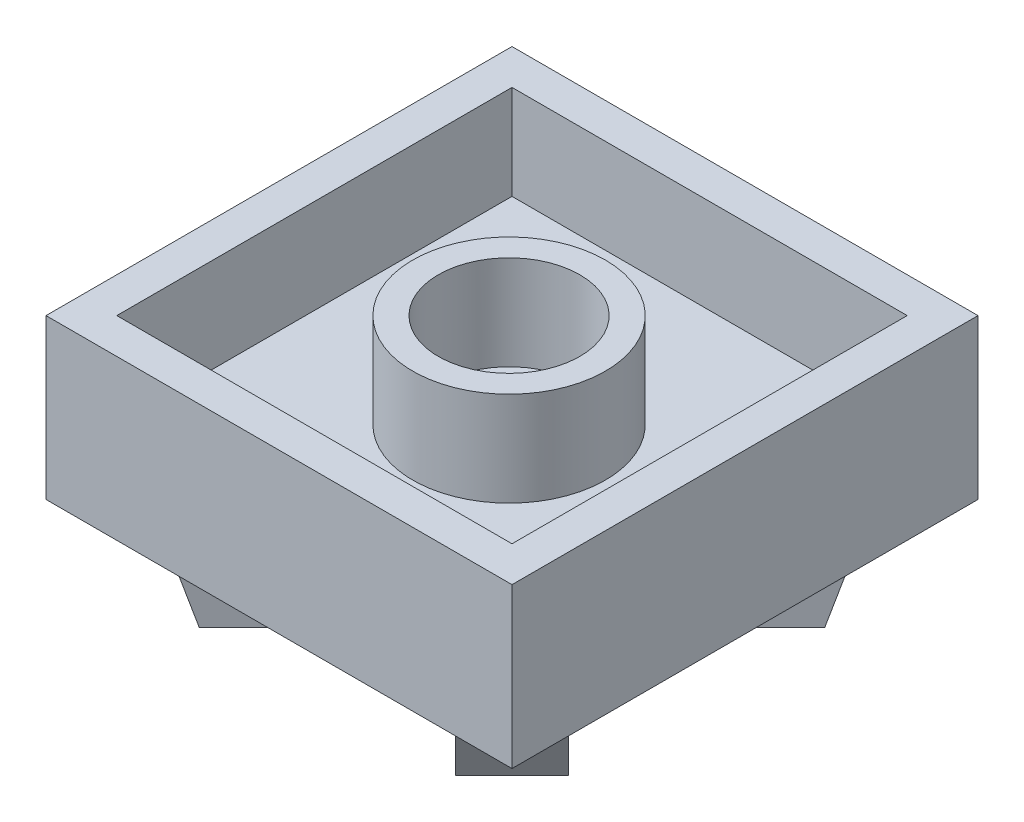
ISO-10303-21;
HEADER;
FILE_DESCRIPTION(('STEP AP214'),'2;1');
FILE_NAME('part.step','',(''),(''),'','','');
FILE_SCHEMA(('AUTOMOTIVE_DESIGN { 1 0 10303 214 1 1 1 1 }'));
ENDSEC;
DATA;
#1=APPLICATION_CONTEXT('core data for automotive mechanical design processes');
#2=APPLICATION_PROTOCOL_DEFINITION('international standard','automotive_design',2000,#1);
#3=PRODUCT_CONTEXT('',#1,'mechanical');
#4=PRODUCT('Part','Part','',(#3));
#5=PRODUCT_RELATED_PRODUCT_CATEGORY('part','',(#4));
#6=PRODUCT_DEFINITION_FORMATION('','',#4);
#7=PRODUCT_DEFINITION_CONTEXT('part definition',#1,'design');
#8=PRODUCT_DEFINITION('design','',#6,#7);
#9=PRODUCT_DEFINITION_SHAPE('','',#8);
#10=(LENGTH_UNIT() NAMED_UNIT(*) SI_UNIT(.MILLI.,.METRE.));
#11=(NAMED_UNIT(*) PLANE_ANGLE_UNIT() SI_UNIT($,.RADIAN.));
#12=(NAMED_UNIT(*) SI_UNIT($,.STERADIAN.) SOLID_ANGLE_UNIT());
#13=UNCERTAINTY_MEASURE_WITH_UNIT(LENGTH_MEASURE(1.E-05),#10,'distance_accuracy_value','');
#14=(GEOMETRIC_REPRESENTATION_CONTEXT(3) GLOBAL_UNCERTAINTY_ASSIGNED_CONTEXT((#13)) GLOBAL_UNIT_ASSIGNED_CONTEXT((#10,
#11,#12)) REPRESENTATION_CONTEXT('',''));
#15=CARTESIAN_POINT('',(0.,0.,0.));
#16=DIRECTION('',(0.,0.,1.));
#17=DIRECTION('',(1.,0.,0.));
#18=AXIS2_PLACEMENT_3D('',#15,#16,#17);
#19=CARTESIAN_POINT('',(0.,-5.4,0.));
#20=DIRECTION('',(0.,-1.,0.));
#21=DIRECTION('',(0.,0.,-1.));
#22=AXIS2_PLACEMENT_3D('',#19,#20,#21);
#23=PLANE('',#22);
#24=DIRECTION('',(0.,0.,1.));
#25=VECTOR('',#24,1.);
#26=CARTESIAN_POINT('',(0.,-5.4,0.));
#27=LINE('',#26,#25);
#28=CARTESIAN_POINT('',(0.,-5.4,-15.8));
#29=VERTEX_POINT('',#28);
#30=CARTESIAN_POINT('',(0.,-5.4,0.));
#31=VERTEX_POINT('',#30);
#32=EDGE_CURVE('E371',#29,#31,#27,.T.);
#33=ORIENTED_EDGE('',*,*,#32,.F.);
#34=DIRECTION('',(-1.,0.,0.));
#35=VECTOR('',#34,1.);
#36=CARTESIAN_POINT('',(0.,-5.4,-15.8));
#37=LINE('',#36,#35);
#38=CARTESIAN_POINT('',(15.8,-5.4,-15.8));
#39=VERTEX_POINT('',#38);
#40=EDGE_CURVE('E381',#39,#29,#37,.T.);
#41=ORIENTED_EDGE('',*,*,#40,.F.);
#42=DIRECTION('',(0.,0.,-1.));
#43=VECTOR('',#42,1.);
#44=CARTESIAN_POINT('',(15.8,-5.4,0.));
#45=LINE('',#44,#43);
#46=CARTESIAN_POINT('',(15.8,-5.4,0.));
#47=VERTEX_POINT('',#46);
#48=EDGE_CURVE('E378',#47,#39,#45,.T.);
#49=ORIENTED_EDGE('',*,*,#48,.F.);
#50=DIRECTION('',(1.,0.,0.));
#51=VECTOR('',#50,1.);
#52=CARTESIAN_POINT('',(0.,-5.4,0.));
#53=LINE('',#52,#51);
#54=EDGE_CURVE('E374',#31,#47,#53,.T.);
#55=ORIENTED_EDGE('',*,*,#54,.F.);
#56=EDGE_LOOP('',(#33,#41,#49,#55));
#57=FACE_BOUND('',#56,.T.);
#58=DIRECTION('',(0.707106781186541,0.,0.707106781186555));
#59=VECTOR('',#58,1.);
#60=CARTESIAN_POINT('',(12.8851028073652,-5.4,-14.7942911165688));
#61=LINE('',#60,#59);
#62=CARTESIAN_POINT('',(12.8851028073652,-5.4,-14.7942911165688));
#63=VERTEX_POINT('',#62);
#64=CARTESIAN_POINT('',(14.7942911165689,-5.4,-12.8851028073651));
#65=VERTEX_POINT('',#64);
#66=EDGE_CURVE('E216',#63,#65,#61,.T.);
#67=ORIENTED_EDGE('',*,*,#66,.F.);
#68=DIRECTION('',(0.707106781186557,0.,-0.707106781186538));
#69=VECTOR('',#68,1.);
#70=CARTESIAN_POINT('',(6.94540584539818,-5.4,-8.85459415460189));
#71=LINE('',#70,#69);
#72=CARTESIAN_POINT('',(10.4596625235593,-5.4,-12.3688508327629));
#73=VERTEX_POINT('',#72);
#74=EDGE_CURVE('E199',#73,#63,#71,.T.);
#75=ORIENTED_EDGE('',*,*,#74,.F.);
#76=CARTESIAN_POINT('',(7.9,-5.4,-7.9));
#77=DIRECTION('',(0.,-1.,0.));
#78=DIRECTION('',(0.,0.,-1.));
#79=AXIS2_PLACEMENT_3D('',#76,#77,#78);
#80=CIRCLE('',#79,5.15);
#81=CARTESIAN_POINT('',(5.34033747644073,-5.4,-12.368850832763));
#82=VERTEX_POINT('',#81);
#83=EDGE_CURVE('E738',#82,#73,#80,.T.);
#84=ORIENTED_EDGE('',*,*,#83,.F.);
#85=DIRECTION('',(-0.707106781186548,0.,-0.707106781186547));
#86=VECTOR('',#85,1.);
#87=CARTESIAN_POINT('',(8.85459415460185,-5.4,-8.85459415460184));
#88=LINE('',#87,#86);
#89=CARTESIAN_POINT('',(2.91489719263485,-5.4,-14.7942911165688));
#90=VERTEX_POINT('',#89);
#91=EDGE_CURVE('E61',#82,#90,#88,.T.);
#92=ORIENTED_EDGE('',*,*,#91,.T.);
#93=DIRECTION('',(0.707106781186547,0.,-0.707106781186548));
#94=VECTOR('',#93,1.);
#95=CARTESIAN_POINT('',(1.00570888343117,-5.4,-12.8851028073652));
#96=LINE('',#95,#94);
#97=CARTESIAN_POINT('',(1.00570888343117,-5.4,-12.8851028073652));
#98=VERTEX_POINT('',#97);
#99=EDGE_CURVE('E229',#98,#90,#96,.T.);
#100=ORIENTED_EDGE('',*,*,#99,.F.);
#101=DIRECTION('',(-0.707106781186546,0.,-0.707106781186549));
#102=VECTOR('',#101,1.);
#103=CARTESIAN_POINT('',(6.94540584539812,-5.4,-6.94540584539817));
#104=LINE('',#103,#102);
#105=CARTESIAN_POINT('',(3.43114916723705,-5.4,-10.4596625235593));
#106=VERTEX_POINT('',#105);
#107=EDGE_CURVE('E257',#106,#98,#104,.T.);
#108=ORIENTED_EDGE('',*,*,#107,.F.);
#109=CARTESIAN_POINT('',(3.43114916723703,-5.4,-5.34033747644074));
#110=VERTEX_POINT('',#109);
#111=EDGE_CURVE('E329',#110,#106,#80,.T.);
#112=ORIENTED_EDGE('',*,*,#111,.F.);
#113=DIRECTION('',(-0.707106781186549,0.,0.707106781186546));
#114=VECTOR('',#113,1.);
#115=CARTESIAN_POINT('',(6.94540584539816,-5.4,-8.85459415460185));
#116=LINE('',#115,#114);
#117=CARTESIAN_POINT('',(1.00570888343115,-5.4,-2.91489719263487));
#118=VERTEX_POINT('',#117);
#119=EDGE_CURVE('E271',#110,#118,#116,.T.);
#120=ORIENTED_EDGE('',*,*,#119,.T.);
#121=DIRECTION('',(-0.707106781186546,0.,-0.70710678118655));
#122=VECTOR('',#121,1.);
#123=CARTESIAN_POINT('',(2.91489719263482,-5.4,-1.00570888343118));
#124=LINE('',#123,#122);
#125=CARTESIAN_POINT('',(2.91489719263482,-5.4,-1.00570888343118));
#126=VERTEX_POINT('',#125);
#127=EDGE_CURVE('E237',#126,#118,#124,.T.);
#128=ORIENTED_EDGE('',*,*,#127,.F.);
#129=DIRECTION('',(-0.707106781186552,0.,0.707106781186543));
#130=VECTOR('',#129,1.);
#131=CARTESIAN_POINT('',(8.85459415460183,-5.4,-6.94540584539812));
#132=LINE('',#131,#130);
#133=CARTESIAN_POINT('',(5.34033747644071,-5.4,-3.43114916723705));
#134=VERTEX_POINT('',#133);
#135=EDGE_CURVE('E276',#134,#126,#132,.T.);
#136=ORIENTED_EDGE('',*,*,#135,.F.);
#137=CARTESIAN_POINT('',(10.4596625235593,-5.4,-3.43114916723704));
#138=VERTEX_POINT('',#137);
#139=EDGE_CURVE('E326',#138,#134,#80,.T.);
#140=ORIENTED_EDGE('',*,*,#139,.F.);
#141=DIRECTION('',(0.707106781186548,0.,0.707106781186547));
#142=VECTOR('',#141,1.);
#143=CARTESIAN_POINT('',(6.94540584539815,-5.4,-6.94540584539816));
#144=LINE('',#143,#142);
#145=CARTESIAN_POINT('',(12.8851028073652,-5.4,-1.00570888343117));
#146=VERTEX_POINT('',#145);
#147=EDGE_CURVE('E300',#138,#146,#144,.T.);
#148=ORIENTED_EDGE('',*,*,#147,.T.);
#149=DIRECTION('',(-0.707106781186547,0.,0.707106781186548));
#150=VECTOR('',#149,1.);
#151=CARTESIAN_POINT('',(14.7942911165688,-5.4,-2.91489719263485));
#152=LINE('',#151,#150);
#153=CARTESIAN_POINT('',(14.7942911165688,-5.4,-2.91489719263485));
#154=VERTEX_POINT('',#153);
#155=EDGE_CURVE('E295',#154,#146,#152,.T.);
#156=ORIENTED_EDGE('',*,*,#155,.F.);
#157=DIRECTION('',(0.707106781186546,0.,0.707106781186549));
#158=VECTOR('',#157,1.);
#159=CARTESIAN_POINT('',(8.85459415460188,-5.4,-8.85459415460183));
#160=LINE('',#159,#158);
#161=CARTESIAN_POINT('',(12.368850832763,-5.4,-5.34033747644073));
#162=VERTEX_POINT('',#161);
#163=EDGE_CURVE('E305',#162,#154,#160,.T.);
#164=ORIENTED_EDGE('',*,*,#163,.F.);
#165=CARTESIAN_POINT('',(12.368850832763,-5.4,-10.4596625235592));
#166=VERTEX_POINT('',#165);
#167=EDGE_CURVE('E321',#166,#162,#80,.T.);
#168=ORIENTED_EDGE('',*,*,#167,.F.);
#169=DIRECTION('',(0.707106781186554,0.,-0.707106781186541));
#170=VECTOR('',#169,1.);
#171=CARTESIAN_POINT('',(8.85459415460183,-5.4,-6.94540584539814));
#172=LINE('',#171,#170);
#173=EDGE_CURVE('E53',#166,#65,#172,.T.);
#174=ORIENTED_EDGE('',*,*,#173,.T.);
#175=EDGE_LOOP('',(#67,#75,#84,#92,#100,#108,#112,#120,#128,#136,#140,#148,#156,#164,#168,#174));
#176=FACE_BOUND('',#175,.T.);
#177=ADVANCED_FACE('F38',(#57,#176),#23,.T.);
#178=CARTESIAN_POINT('',(0.,-5.4,0.));
#179=DIRECTION('',(-1.,0.,0.));
#180=DIRECTION('',(0.,0.,1.));
#181=AXIS2_PLACEMENT_3D('',#178,#179,#180);
#182=PLANE('',#181);
#183=DIRECTION('',(0.,0.,1.));
#184=VECTOR('',#183,1.);
#185=CARTESIAN_POINT('',(0.,0.,0.));
#186=LINE('',#185,#184);
#187=CARTESIAN_POINT('',(0.,0.,-15.8));
#188=VERTEX_POINT('',#187);
#189=CARTESIAN_POINT('',(0.,0.,0.));
#190=VERTEX_POINT('',#189);
#191=EDGE_CURVE('E370',#188,#190,#186,.T.);
#192=ORIENTED_EDGE('',*,*,#191,.F.);
#193=DIRECTION('',(0.,1.,0.));
#194=VECTOR('',#193,1.);
#195=CARTESIAN_POINT('',(0.,-5.4,-15.8));
#196=LINE('',#195,#194);
#197=EDGE_CURVE('E46',#29,#188,#196,.T.);
#198=ORIENTED_EDGE('',*,*,#197,.F.);
#199=ORIENTED_EDGE('',*,*,#32,.T.);
#200=DIRECTION('',(0.,1.,0.));
#201=VECTOR('',#200,1.);
#202=CARTESIAN_POINT('',(0.,-5.4,0.));
#203=LINE('',#202,#201);
#204=EDGE_CURVE('E384',#31,#190,#203,.T.);
#205=ORIENTED_EDGE('',*,*,#204,.T.);
#206=EDGE_LOOP('',(#192,#198,#199,#205));
#207=FACE_BOUND('',#206,.T.);
#208=ADVANCED_FACE('F40',(#207),#182,.T.);
#209=CARTESIAN_POINT('',(0.,-5.4,-15.8));
#210=DIRECTION('',(0.,0.,-1.));
#211=DIRECTION('',(-1.,0.,0.));
#212=AXIS2_PLACEMENT_3D('',#209,#210,#211);
#213=PLANE('',#212);
#214=DIRECTION('',(-1.,0.,0.));
#215=VECTOR('',#214,1.);
#216=CARTESIAN_POINT('',(0.,0.,-15.8));
#217=LINE('',#216,#215);
#218=CARTESIAN_POINT('',(15.8,0.,-15.8));
#219=VERTEX_POINT('',#218);
#220=EDGE_CURVE('E375',#219,#188,#217,.T.);
#221=ORIENTED_EDGE('',*,*,#220,.F.);
#222=DIRECTION('',(0.,1.,0.));
#223=VECTOR('',#222,1.);
#224=CARTESIAN_POINT('',(15.8,-5.4,-15.8));
#225=LINE('',#224,#223);
#226=EDGE_CURVE('E396',#39,#219,#225,.T.);
#227=ORIENTED_EDGE('',*,*,#226,.F.);
#228=ORIENTED_EDGE('',*,*,#40,.T.);
#229=ORIENTED_EDGE('',*,*,#197,.T.);
#230=EDGE_LOOP('',(#221,#227,#228,#229));
#231=FACE_BOUND('',#230,.T.);
#232=ADVANCED_FACE('F411',(#231),#213,.T.);
#233=CARTESIAN_POINT('',(15.8,-5.4,0.));
#234=DIRECTION('',(1.,0.,0.));
#235=DIRECTION('',(0.,0.,-1.));
#236=AXIS2_PLACEMENT_3D('',#233,#234,#235);
#237=PLANE('',#236);
#238=DIRECTION('',(0.,0.,-1.));
#239=VECTOR('',#238,1.);
#240=CARTESIAN_POINT('',(15.8,0.,0.));
#241=LINE('',#240,#239);
#242=CARTESIAN_POINT('',(15.8,0.,0.));
#243=VERTEX_POINT('',#242);
#244=EDGE_CURVE('E390',#243,#219,#241,.T.);
#245=ORIENTED_EDGE('',*,*,#244,.F.);
#246=DIRECTION('',(0.,1.,0.));
#247=VECTOR('',#246,1.);
#248=CARTESIAN_POINT('',(15.8,-5.4,0.));
#249=LINE('',#248,#247);
#250=EDGE_CURVE('E398',#47,#243,#249,.T.);
#251=ORIENTED_EDGE('',*,*,#250,.F.);
#252=ORIENTED_EDGE('',*,*,#48,.T.);
#253=ORIENTED_EDGE('',*,*,#226,.T.);
#254=EDGE_LOOP('',(#245,#251,#252,#253));
#255=FACE_BOUND('',#254,.T.);
#256=ADVANCED_FACE('F416',(#255),#237,.T.);
#257=CARTESIAN_POINT('',(0.,-5.4,0.));
#258=DIRECTION('',(0.,0.,1.));
#259=DIRECTION('',(1.,0.,0.));
#260=AXIS2_PLACEMENT_3D('',#257,#258,#259);
#261=PLANE('',#260);
#262=DIRECTION('',(1.,0.,0.));
#263=VECTOR('',#262,1.);
#264=CARTESIAN_POINT('',(0.,0.,0.));
#265=LINE('',#264,#263);
#266=EDGE_CURVE('E387',#190,#243,#265,.T.);
#267=ORIENTED_EDGE('',*,*,#266,.F.);
#268=ORIENTED_EDGE('',*,*,#204,.F.);
#269=ORIENTED_EDGE('',*,*,#54,.T.);
#270=ORIENTED_EDGE('',*,*,#250,.T.);
#271=EDGE_LOOP('',(#267,#268,#269,#270));
#272=FACE_BOUND('',#271,.T.);
#273=ADVANCED_FACE('F405',(#272),#261,.T.);
#274=CARTESIAN_POINT('',(0.,0.,0.));
#275=DIRECTION('',(0.,-1.,0.));
#276=DIRECTION('',(0.,0.,-1.));
#277=AXIS2_PLACEMENT_3D('',#274,#275,#276);
#278=PLANE('',#277);
#279=DIRECTION('',(0.,0.,1.));
#280=VECTOR('',#279,1.);
#281=CARTESIAN_POINT('',(1.2,0.,-14.6));
#282=LINE('',#281,#280);
#283=CARTESIAN_POINT('',(1.2,0.,-14.6));
#284=VERTEX_POINT('',#283);
#285=CARTESIAN_POINT('',(1.2,0.,-1.2));
#286=VERTEX_POINT('',#285);
#287=EDGE_CURVE('E342',#284,#286,#282,.T.);
#288=ORIENTED_EDGE('',*,*,#287,.F.);
#289=DIRECTION('',(-1.,0.,0.));
#290=VECTOR('',#289,1.);
#291=CARTESIAN_POINT('',(14.6,0.,-14.6));
#292=LINE('',#291,#290);
#293=CARTESIAN_POINT('',(14.6,0.,-14.6));
#294=VERTEX_POINT('',#293);
#295=EDGE_CURVE('E345',#294,#284,#292,.T.);
#296=ORIENTED_EDGE('',*,*,#295,.F.);
#297=DIRECTION('',(0.,0.,-1.));
#298=VECTOR('',#297,1.);
#299=CARTESIAN_POINT('',(14.6,0.,-14.6));
#300=LINE('',#299,#298);
#301=CARTESIAN_POINT('',(14.6,0.,-1.2));
#302=VERTEX_POINT('',#301);
#303=EDGE_CURVE('E338',#302,#294,#300,.T.);
#304=ORIENTED_EDGE('',*,*,#303,.F.);
#305=DIRECTION('',(1.,0.,0.));
#306=VECTOR('',#305,1.);
#307=CARTESIAN_POINT('',(14.6,0.,-1.2));
#308=LINE('',#307,#306);
#309=EDGE_CURVE('E339',#286,#302,#308,.T.);
#310=ORIENTED_EDGE('',*,*,#309,.F.);
#311=EDGE_LOOP('',(#288,#296,#304,#310));
#312=FACE_BOUND('',#311,.T.);
#313=ORIENTED_EDGE('',*,*,#191,.T.);
#314=ORIENTED_EDGE('',*,*,#266,.T.);
#315=ORIENTED_EDGE('',*,*,#244,.T.);
#316=ORIENTED_EDGE('',*,*,#220,.T.);
#317=EDGE_LOOP('',(#313,#314,#315,#316));
#318=FACE_BOUND('',#317,.T.);
#319=ADVANCED_FACE('F408',(#312,#318),#278,.F.);
#320=CARTESIAN_POINT('',(0.,-3.2,0.));
#321=DIRECTION('',(0.,-1.,0.));
#322=DIRECTION('',(0.,0.,-1.));
#323=AXIS2_PLACEMENT_3D('',#320,#321,#322);
#324=PLANE('',#323);
#325=CARTESIAN_POINT('',(7.85,-3.2,-7.85));
#326=DIRECTION('',(0.,-1.,0.));
#327=DIRECTION('',(0.,0.,-1.));
#328=AXIS2_PLACEMENT_3D('',#325,#326,#327);
#329=CIRCLE('',#328,3.265);
#330=CARTESIAN_POINT('',(7.85,-3.2,-11.115));
#331=VERTEX_POINT('',#330);
#332=EDGE_CURVE('E12',#331,#331,#329,.F.);
#333=ORIENTED_EDGE('',*,*,#332,.F.);
#334=EDGE_LOOP('',(#333));
#335=FACE_BOUND('',#334,.T.);
#336=DIRECTION('',(0.,0.,-1.));
#337=VECTOR('',#336,1.);
#338=CARTESIAN_POINT('',(14.6,-3.2,-14.6));
#339=LINE('',#338,#337);
#340=CARTESIAN_POINT('',(14.6,-3.2,-1.2));
#341=VERTEX_POINT('',#340);
#342=CARTESIAN_POINT('',(14.6,-3.2,-14.6));
#343=VERTEX_POINT('',#342);
#344=EDGE_CURVE('E353',#341,#343,#339,.T.);
#345=ORIENTED_EDGE('',*,*,#344,.T.);
#346=DIRECTION('',(-1.,0.,0.));
#347=VECTOR('',#346,1.);
#348=CARTESIAN_POINT('',(14.6,-3.2,-14.6));
#349=LINE('',#348,#347);
#350=CARTESIAN_POINT('',(1.2,-3.2,-14.6));
#351=VERTEX_POINT('',#350);
#352=EDGE_CURVE('E341',#343,#351,#349,.T.);
#353=ORIENTED_EDGE('',*,*,#352,.T.);
#354=DIRECTION('',(0.,0.,1.));
#355=VECTOR('',#354,1.);
#356=CARTESIAN_POINT('',(1.2,-3.2,-14.6));
#357=LINE('',#356,#355);
#358=CARTESIAN_POINT('',(1.2,-3.2,-1.2));
#359=VERTEX_POINT('',#358);
#360=EDGE_CURVE('E362',#351,#359,#357,.T.);
#361=ORIENTED_EDGE('',*,*,#360,.T.);
#362=DIRECTION('',(1.,0.,0.));
#363=VECTOR('',#362,1.);
#364=CARTESIAN_POINT('',(14.6,-3.2,-1.2));
#365=LINE('',#364,#363);
#366=EDGE_CURVE('E358',#359,#341,#365,.T.);
#367=ORIENTED_EDGE('',*,*,#366,.T.);
#368=EDGE_LOOP('',(#345,#353,#361,#367));
#369=FACE_BOUND('',#368,.T.);
#370=ADVANCED_FACE('F431',(#335,#369),#324,.F.);
#371=CARTESIAN_POINT('',(14.6,-24.3504617357995,-14.6));
#372=DIRECTION('',(0.,0.,-1.));
#373=DIRECTION('',(-1.,0.,0.));
#374=AXIS2_PLACEMENT_3D('',#371,#372,#373);
#375=PLANE('',#374);
#376=DIRECTION('',(0.,1.,0.));
#377=VECTOR('',#376,1.);
#378=CARTESIAN_POINT('',(14.6,-24.3504617357995,-14.6));
#379=LINE('',#378,#377);
#380=EDGE_CURVE('E356',#343,#294,#379,.T.);
#381=ORIENTED_EDGE('',*,*,#380,.T.);
#382=ORIENTED_EDGE('',*,*,#295,.T.);
#383=DIRECTION('',(0.,1.,0.));
#384=VECTOR('',#383,1.);
#385=CARTESIAN_POINT('',(1.2,-24.3504617357995,-14.6));
#386=LINE('',#385,#384);
#387=EDGE_CURVE('E352',#351,#284,#386,.T.);
#388=ORIENTED_EDGE('',*,*,#387,.F.);
#389=ORIENTED_EDGE('',*,*,#352,.F.);
#390=EDGE_LOOP('',(#381,#382,#388,#389));
#391=FACE_BOUND('',#390,.T.);
#392=ADVANCED_FACE('F438',(#391),#375,.F.);
#393=CARTESIAN_POINT('',(1.2,-24.3504617357995,-14.6));
#394=DIRECTION('',(-1.,0.,0.));
#395=DIRECTION('',(0.,0.,1.));
#396=AXIS2_PLACEMENT_3D('',#393,#394,#395);
#397=PLANE('',#396);
#398=ORIENTED_EDGE('',*,*,#387,.T.);
#399=ORIENTED_EDGE('',*,*,#287,.T.);
#400=DIRECTION('',(0.,1.,0.));
#401=VECTOR('',#400,1.);
#402=CARTESIAN_POINT('',(1.2,-24.3504617357995,-1.2));
#403=LINE('',#402,#401);
#404=EDGE_CURVE('E361',#359,#286,#403,.T.);
#405=ORIENTED_EDGE('',*,*,#404,.F.);
#406=ORIENTED_EDGE('',*,*,#360,.F.);
#407=EDGE_LOOP('',(#398,#399,#405,#406));
#408=FACE_BOUND('',#407,.T.);
#409=ADVANCED_FACE('F447',(#408),#397,.F.);
#410=CARTESIAN_POINT('',(14.6,-24.3504617357995,-1.2));
#411=DIRECTION('',(0.,0.,1.));
#412=DIRECTION('',(1.,0.,0.));
#413=AXIS2_PLACEMENT_3D('',#410,#411,#412);
#414=PLANE('',#413);
#415=ORIENTED_EDGE('',*,*,#404,.T.);
#416=ORIENTED_EDGE('',*,*,#309,.T.);
#417=DIRECTION('',(0.,1.,0.));
#418=VECTOR('',#417,1.);
#419=CARTESIAN_POINT('',(14.6,-24.3504617357995,-1.2));
#420=LINE('',#419,#418);
#421=EDGE_CURVE('E357',#341,#302,#420,.T.);
#422=ORIENTED_EDGE('',*,*,#421,.F.);
#423=ORIENTED_EDGE('',*,*,#366,.F.);
#424=EDGE_LOOP('',(#415,#416,#422,#423));
#425=FACE_BOUND('',#424,.T.);
#426=ADVANCED_FACE('F455',(#425),#414,.F.);
#427=CARTESIAN_POINT('',(14.6,-24.3504617357995,-14.6));
#428=DIRECTION('',(1.,0.,0.));
#429=DIRECTION('',(0.,0.,-1.));
#430=AXIS2_PLACEMENT_3D('',#427,#428,#429);
#431=PLANE('',#430);
#432=ORIENTED_EDGE('',*,*,#421,.T.);
#433=ORIENTED_EDGE('',*,*,#303,.T.);
#434=ORIENTED_EDGE('',*,*,#380,.F.);
#435=ORIENTED_EDGE('',*,*,#344,.F.);
#436=EDGE_LOOP('',(#432,#433,#434,#435));
#437=FACE_BOUND('',#436,.T.);
#438=ADVANCED_FACE('F452',(#437),#431,.F.);
#439=CARTESIAN_POINT('',(7.85,9.23481456229631,-7.85));
#440=DIRECTION('',(0.,-1.,0.));
#441=DIRECTION('',(0.,0.,-1.));
#442=AXIS2_PLACEMENT_3D('',#439,#440,#441);
#443=CYLINDRICAL_SURFACE('',#442,3.265);
#444=CARTESIAN_POINT('',(7.85,0.,-7.85));
#445=DIRECTION('',(0.,-1.,0.));
#446=DIRECTION('',(0.,0.,-1.));
#447=AXIS2_PLACEMENT_3D('',#444,#445,#446);
#448=CIRCLE('',#447,3.265);
#449=CARTESIAN_POINT('',(7.85,0.,-11.115));
#450=VERTEX_POINT('',#449);
#451=EDGE_CURVE('E332',#450,#450,#448,.T.);
#452=ORIENTED_EDGE('',*,*,#451,.T.);
#453=EDGE_LOOP('',(#452));
#454=FACE_BOUND('',#453,.T.);
#455=ORIENTED_EDGE('',*,*,#332,.T.);
#456=EDGE_LOOP('',(#455));
#457=FACE_BOUND('',#456,.T.);
#458=ADVANCED_FACE('F463',(#454,#457),#443,.T.);
#459=CARTESIAN_POINT('',(7.85,9.23481456229631,-7.85));
#460=DIRECTION('',(0.,-1.,0.));
#461=DIRECTION('',(0.,0.,-1.));
#462=AXIS2_PLACEMENT_3D('',#459,#460,#461);
#463=CYLINDRICAL_SURFACE('',#462,2.4);
#464=CARTESIAN_POINT('',(7.85,0.,-7.85));
#465=DIRECTION('',(0.,-1.,0.));
#466=DIRECTION('',(0.,0.,-1.));
#467=AXIS2_PLACEMENT_3D('',#464,#465,#466);
#468=CIRCLE('',#467,2.4);
#469=CARTESIAN_POINT('',(7.85,0.,-10.25));
#470=VERTEX_POINT('',#469);
#471=EDGE_CURVE('E335',#470,#470,#468,.T.);
#472=ORIENTED_EDGE('',*,*,#471,.F.);
#473=EDGE_LOOP('',(#472));
#474=FACE_BOUND('',#473,.T.);
#475=CARTESIAN_POINT('',(7.85,-3.2,-7.85));
#476=DIRECTION('',(0.,1.,0.));
#477=DIRECTION('',(0.,0.,1.));
#478=AXIS2_PLACEMENT_3D('',#475,#476,#477);
#479=CIRCLE('',#478,2.4);
#480=CARTESIAN_POINT('',(7.85,-3.2,-5.45));
#481=VERTEX_POINT('',#480);
#482=EDGE_CURVE('E325',#481,#481,#479,.T.);
#483=ORIENTED_EDGE('',*,*,#482,.F.);
#484=EDGE_LOOP('',(#483));
#485=FACE_BOUND('',#484,.T.);
#486=ADVANCED_FACE('F501',(#474,#485),#463,.F.);
#487=CARTESIAN_POINT('',(0.,0.,0.));
#488=DIRECTION('',(0.,-1.,0.));
#489=DIRECTION('',(0.,0.,-1.));
#490=AXIS2_PLACEMENT_3D('',#487,#488,#489);
#491=PLANE('',#490);
#492=ORIENTED_EDGE('',*,*,#471,.T.);
#493=EDGE_LOOP('',(#492));
#494=FACE_BOUND('',#493,.T.);
#495=ORIENTED_EDGE('',*,*,#451,.F.);
#496=EDGE_LOOP('',(#495));
#497=FACE_BOUND('',#496,.T.);
#498=ADVANCED_FACE('F511',(#494,#497),#491,.F.);
#499=ORIENTED_EDGE('',*,*,#482,.T.);
#500=EDGE_LOOP('',(#499));
#501=FACE_BOUND('',#500,.T.);
#502=ADVANCED_FACE('F440',(#501),#324,.F.);
#503=CARTESIAN_POINT('',(7.9,-5.1,-7.9));
#504=DIRECTION('',(0.,-1.,0.));
#505=DIRECTION('',(0.,0.,-1.));
#506=AXIS2_PLACEMENT_3D('',#503,#504,#505);
#507=CYLINDRICAL_SURFACE('',#506,5.15);
#508=CARTESIAN_POINT('',(7.9,-5.1,-7.9));
#509=DIRECTION('',(0.,-1.,0.));
#510=DIRECTION('',(0.,0.,-1.));
#511=AXIS2_PLACEMENT_3D('',#508,#509,#510);
#512=CIRCLE('',#511,5.15);
#513=CARTESIAN_POINT('',(7.9,-5.1,-13.05));
#514=VERTEX_POINT('',#513);
#515=EDGE_CURVE('E322',#514,#514,#512,.T.);
#516=ORIENTED_EDGE('',*,*,#515,.F.);
#517=EDGE_LOOP('',(#516));
#518=FACE_BOUND('',#517,.T.);
#519=ORIENTED_EDGE('',*,*,#139,.T.);
#520=DIRECTION('',(0.,1.,0.));
#521=VECTOR('',#520,1.);
#522=CARTESIAN_POINT('',(5.34033747644071,-8.2,-3.43114916723705));
#523=LINE('',#522,#521);
#524=CARTESIAN_POINT('',(5.34033747644071,-8.2,-3.43114916723705));
#525=VERTEX_POINT('',#524);
#526=EDGE_CURVE('E284',#525,#134,#523,.T.);
#527=ORIENTED_EDGE('',*,*,#526,.F.);
#528=CARTESIAN_POINT('',(7.9,-8.2,-7.9));
#529=DIRECTION('',(0.,-1.,0.));
#530=DIRECTION('',(1.,0.,0.));
#531=AXIS2_PLACEMENT_3D('',#528,#529,#530);
#532=CIRCLE('',#531,5.15);
#533=CARTESIAN_POINT('',(3.43114916723704,-8.2,-5.34033747644074));
#534=VERTEX_POINT('',#533);
#535=EDGE_CURVE('E275',#534,#525,#532,.F.);
#536=ORIENTED_EDGE('',*,*,#535,.F.);
#537=DIRECTION('',(0.,1.,0.));
#538=VECTOR('',#537,1.);
#539=CARTESIAN_POINT('',(3.43114916723704,-8.2,-5.34033747644074));
#540=LINE('',#539,#538);
#541=EDGE_CURVE('E288',#534,#110,#540,.T.);
#542=ORIENTED_EDGE('',*,*,#541,.T.);
#543=ORIENTED_EDGE('',*,*,#111,.T.);
#544=DIRECTION('',(0.,1.,0.));
#545=VECTOR('',#544,1.);
#546=CARTESIAN_POINT('',(3.43114916723705,-8.2,-10.4596625235593));
#547=LINE('',#546,#545);
#548=CARTESIAN_POINT('',(3.43114916723705,-8.2,-10.4596625235593));
#549=VERTEX_POINT('',#548);
#550=EDGE_CURVE('E265',#549,#106,#547,.T.);
#551=ORIENTED_EDGE('',*,*,#550,.F.);
#552=CARTESIAN_POINT('',(7.9,-8.2,-7.9));
#553=DIRECTION('',(0.,-1.,0.));
#554=DIRECTION('',(0.,0.,1.));
#555=AXIS2_PLACEMENT_3D('',#552,#553,#554);
#556=CIRCLE('',#555,5.15);
#557=CARTESIAN_POINT('',(5.34033747644072,-8.2,-12.368850832763));
#558=VERTEX_POINT('',#557);
#559=EDGE_CURVE('E256',#558,#549,#556,.F.);
#560=ORIENTED_EDGE('',*,*,#559,.F.);
#561=DIRECTION('',(0.,1.,0.));
#562=VECTOR('',#561,1.);
#563=CARTESIAN_POINT('',(5.34033747644072,-8.2,-12.368850832763));
#564=LINE('',#563,#562);
#565=EDGE_CURVE('E269',#558,#82,#564,.T.);
#566=ORIENTED_EDGE('',*,*,#565,.T.);
#567=ORIENTED_EDGE('',*,*,#83,.T.);
#568=DIRECTION('',(0.,1.,0.));
#569=VECTOR('',#568,1.);
#570=CARTESIAN_POINT('',(10.4596625235593,-8.2,-12.3688508327629));
#571=LINE('',#570,#569);
#572=CARTESIAN_POINT('',(10.4596625235593,-8.2,-12.3688508327629));
#573=VERTEX_POINT('',#572);
#574=EDGE_CURVE('E206',#573,#73,#571,.T.);
#575=ORIENTED_EDGE('',*,*,#574,.F.);
#576=CARTESIAN_POINT('',(7.9,-8.2,-7.9));
#577=DIRECTION('',(0.,-1.,0.));
#578=DIRECTION('',(-1.,0.,0.));
#579=AXIS2_PLACEMENT_3D('',#576,#577,#578);
#580=CIRCLE('',#579,5.15);
#581=CARTESIAN_POINT('',(12.368850832763,-8.2,-10.4596625235592));
#582=VERTEX_POINT('',#581);
#583=EDGE_CURVE('E244',#582,#573,#580,.F.);
#584=ORIENTED_EDGE('',*,*,#583,.F.);
#585=DIRECTION('',(0.,1.,0.));
#586=VECTOR('',#585,1.);
#587=CARTESIAN_POINT('',(12.368850832763,-8.2,-10.4596625235592));
#588=LINE('',#587,#586);
#589=EDGE_CURVE('E251',#582,#166,#588,.T.);
#590=ORIENTED_EDGE('',*,*,#589,.T.);
#591=ORIENTED_EDGE('',*,*,#167,.T.);
#592=DIRECTION('',(0.,1.,0.));
#593=VECTOR('',#592,1.);
#594=CARTESIAN_POINT('',(12.368850832763,-8.2,-5.34033747644072));
#595=LINE('',#594,#593);
#596=CARTESIAN_POINT('',(12.368850832763,-8.2,-5.34033747644072));
#597=VERTEX_POINT('',#596);
#598=EDGE_CURVE('E313',#597,#162,#595,.T.);
#599=ORIENTED_EDGE('',*,*,#598,.F.);
#600=CARTESIAN_POINT('',(7.9,-8.2,-7.9));
#601=DIRECTION('',(0.,-1.,0.));
#602=DIRECTION('',(0.,0.,-1.));
#603=AXIS2_PLACEMENT_3D('',#600,#601,#602);
#604=CIRCLE('',#603,5.15);
#605=CARTESIAN_POINT('',(10.4596625235593,-8.2,-3.43114916723705));
#606=VERTEX_POINT('',#605);
#607=EDGE_CURVE('E304',#606,#597,#604,.F.);
#608=ORIENTED_EDGE('',*,*,#607,.F.);
#609=DIRECTION('',(0.,1.,0.));
#610=VECTOR('',#609,1.);
#611=CARTESIAN_POINT('',(10.4596625235593,-8.2,-3.43114916723705));
#612=LINE('',#611,#610);
#613=EDGE_CURVE('E318',#606,#138,#612,.T.);
#614=ORIENTED_EDGE('',*,*,#613,.T.);
#615=EDGE_LOOP('',(#519,#527,#536,#542,#543,#551,#560,#566,#567,#575,#584,#590,#591,#599,#608,#614));
#616=FACE_BOUND('',#615,.T.);
#617=ADVANCED_FACE('F529',(#518,#616),#507,.F.);
#618=CARTESIAN_POINT('',(7.9,-5.1,-7.9));
#619=DIRECTION('',(0.,-1.,0.));
#620=DIRECTION('',(0.,0.,-1.));
#621=AXIS2_PLACEMENT_3D('',#618,#619,#620);
#622=PLANE('',#621);
#623=ORIENTED_EDGE('',*,*,#515,.T.);
#624=EDGE_LOOP('',(#623));
#625=FACE_BOUND('',#624,.T.);
#626=ADVANCED_FACE('F535',(#625),#622,.T.);
#627=CARTESIAN_POINT('',(6.94540584539815,-8.2,-6.94540584539816));
#628=DIRECTION('',(-0.707106781186547,0.,0.707106781186548));
#629=DIRECTION('',(0.707106781186548,0.,0.707106781186547));
#630=AXIS2_PLACEMENT_3D('',#627,#628,#629);
#631=PLANE('',#630);
#632=ORIENTED_EDGE('',*,*,#147,.F.);
#633=ORIENTED_EDGE('',*,*,#613,.F.);
#634=DIRECTION('',(0.707106781186548,0.,0.707106781186547));
#635=VECTOR('',#634,1.);
#636=CARTESIAN_POINT('',(6.94540584539815,-8.2,-6.94540584539816));
#637=LINE('',#636,#635);
#638=CARTESIAN_POINT('',(12.2487067042973,-8.2,-1.64210498649906));
#639=VERTEX_POINT('',#638);
#640=EDGE_CURVE('E301',#606,#639,#637,.T.);
#641=ORIENTED_EDGE('',*,*,#640,.T.);
#642=DIRECTION('',(0.216381166575455,0.952028561285264,0.216381166575455));
#643=VECTOR('',#642,1.);
#644=CARTESIAN_POINT('',(12.8851028073652,-5.4,-1.00570888343117));
#645=LINE('',#644,#643);
#646=EDGE_CURVE('E291',#639,#146,#645,.T.);
#647=ORIENTED_EDGE('',*,*,#646,.T.);
#648=EDGE_LOOP('',(#632,#633,#641,#647));
#649=FACE_BOUND('',#648,.T.);
#650=ADVANCED_FACE('F540',(#649),#631,.T.);
#651=CARTESIAN_POINT('',(8.85459415460188,-8.2,-8.85459415460183));
#652=DIRECTION('',(-0.707106781186549,0.,0.707106781186546));
#653=DIRECTION('',(0.707106781186546,0.,0.707106781186549));
#654=AXIS2_PLACEMENT_3D('',#651,#652,#653);
#655=PLANE('',#654);
#656=ORIENTED_EDGE('',*,*,#163,.T.);
#657=DIRECTION('',(0.216381166575455,0.952028561285264,0.216381166575455));
#658=VECTOR('',#657,1.);
#659=CARTESIAN_POINT('',(14.7942911165688,-5.4,-2.91489719263485));
#660=LINE('',#659,#658);
#661=CARTESIAN_POINT('',(14.1578950135009,-8.2,-3.55129329570274));
#662=VERTEX_POINT('',#661);
#663=EDGE_CURVE('E292',#662,#154,#660,.T.);
#664=ORIENTED_EDGE('',*,*,#663,.F.);
#665=DIRECTION('',(0.707106781186546,0.,0.707106781186549));
#666=VECTOR('',#665,1.);
#667=CARTESIAN_POINT('',(8.85459415460188,-8.2,-8.85459415460183));
#668=LINE('',#667,#666);
#669=EDGE_CURVE('E307',#597,#662,#668,.T.);
#670=ORIENTED_EDGE('',*,*,#669,.F.);
#671=ORIENTED_EDGE('',*,*,#598,.T.);
#672=EDGE_LOOP('',(#656,#664,#670,#671));
#673=FACE_BOUND('',#672,.T.);
#674=ADVANCED_FACE('F551',(#673),#655,.F.);
#675=CARTESIAN_POINT('',(0.,-8.2,0.));
#676=DIRECTION('',(0.,-1.,0.));
#677=DIRECTION('',(0.,0.,-1.));
#678=AXIS2_PLACEMENT_3D('',#675,#676,#677);
#679=PLANE('',#678);
#680=ORIENTED_EDGE('',*,*,#640,.F.);
#681=ORIENTED_EDGE('',*,*,#607,.T.);
#682=ORIENTED_EDGE('',*,*,#669,.T.);
#683=DIRECTION('',(-0.707106781186548,0.,0.707106781186548));
#684=VECTOR('',#683,1.);
#685=CARTESIAN_POINT('',(5.3033008588991,-8.2,5.3033008588991));
#686=LINE('',#685,#684);
#687=EDGE_CURVE('E310',#662,#639,#686,.T.);
#688=ORIENTED_EDGE('',*,*,#687,.T.);
#689=EDGE_LOOP('',(#680,#681,#682,#688));
#690=FACE_BOUND('',#689,.T.);
#691=ADVANCED_FACE('F563',(#690),#679,.T.);
#692=CARTESIAN_POINT('',(14.7942911165688,-5.4,-2.91489719263485));
#693=DIRECTION('',(0.673185851568084,-0.30600918041312,0.673185851568083));
#694=DIRECTION('',(0.707106781186547,0.,-0.707106781186548));
#695=AXIS2_PLACEMENT_3D('',#692,#693,#694);
#696=PLANE('',#695);
#697=ORIENTED_EDGE('',*,*,#646,.F.);
#698=ORIENTED_EDGE('',*,*,#687,.F.);
#699=ORIENTED_EDGE('',*,*,#663,.T.);
#700=ORIENTED_EDGE('',*,*,#155,.T.);
#701=EDGE_LOOP('',(#697,#698,#699,#700));
#702=FACE_BOUND('',#701,.T.);
#703=ADVANCED_FACE('F574',(#702),#696,.T.);
#704=CARTESIAN_POINT('',(6.94540584539816,-8.2,-8.85459415460185));
#705=DIRECTION('',(-0.707106781186546,0.,-0.707106781186549));
#706=DIRECTION('',(-0.707106781186549,0.,0.707106781186546));
#707=AXIS2_PLACEMENT_3D('',#704,#705,#706);
#708=PLANE('',#707);
#709=ORIENTED_EDGE('',*,*,#119,.F.);
#710=ORIENTED_EDGE('',*,*,#541,.F.);
#711=DIRECTION('',(-0.707106781186549,0.,0.707106781186546));
#712=VECTOR('',#711,1.);
#713=CARTESIAN_POINT('',(6.94540584539816,-8.2,-8.85459415460185));
#714=LINE('',#713,#712);
#715=CARTESIAN_POINT('',(1.64210498649904,-8.2,-3.55129329570276));
#716=VERTEX_POINT('',#715);
#717=EDGE_CURVE('E272',#534,#716,#714,.T.);
#718=ORIENTED_EDGE('',*,*,#717,.T.);
#719=DIRECTION('',(-0.216381166575456,0.952028561285264,0.216381166575454));
#720=VECTOR('',#719,1.);
#721=CARTESIAN_POINT('',(1.00570888343115,-5.4,-2.91489719263487));
#722=LINE('',#721,#720);
#723=EDGE_CURVE('E233',#716,#118,#722,.T.);
#724=ORIENTED_EDGE('',*,*,#723,.T.);
#725=EDGE_LOOP('',(#709,#710,#718,#724));
#726=FACE_BOUND('',#725,.T.);
#727=ADVANCED_FACE('F583',(#726),#708,.T.);
#728=CARTESIAN_POINT('',(8.85459415460183,-8.2,-6.94540584539812));
#729=DIRECTION('',(-0.707106781186543,0.,-0.707106781186552));
#730=DIRECTION('',(-0.707106781186552,0.,0.707106781186543));
#731=AXIS2_PLACEMENT_3D('',#728,#729,#730);
#732=PLANE('',#731);
#733=ORIENTED_EDGE('',*,*,#135,.T.);
#734=DIRECTION('',(-0.216381166575456,0.952028561285264,0.216381166575454));
#735=VECTOR('',#734,1.);
#736=CARTESIAN_POINT('',(2.91489719263482,-5.4,-1.00570888343118));
#737=LINE('',#736,#735);
#738=CARTESIAN_POINT('',(3.55129329570272,-8.2,-1.64210498649907));
#739=VERTEX_POINT('',#738);
#740=EDGE_CURVE('E234',#739,#126,#737,.T.);
#741=ORIENTED_EDGE('',*,*,#740,.F.);
#742=DIRECTION('',(-0.707106781186552,0.,0.707106781186543));
#743=VECTOR('',#742,1.);
#744=CARTESIAN_POINT('',(8.85459415460183,-8.2,-6.94540584539812));
#745=LINE('',#744,#743);
#746=EDGE_CURVE('E278',#525,#739,#745,.T.);
#747=ORIENTED_EDGE('',*,*,#746,.F.);
#748=ORIENTED_EDGE('',*,*,#526,.T.);
#749=EDGE_LOOP('',(#733,#741,#747,#748));
#750=FACE_BOUND('',#749,.T.);
#751=ADVANCED_FACE('F610',(#750),#732,.F.);
#752=CARTESIAN_POINT('',(0.,-8.2,-15.8));
#753=DIRECTION('',(0.,-1.,0.));
#754=DIRECTION('',(1.,0.,0.));
#755=AXIS2_PLACEMENT_3D('',#752,#753,#754);
#756=PLANE('',#755);
#757=ORIENTED_EDGE('',*,*,#717,.F.);
#758=ORIENTED_EDGE('',*,*,#535,.T.);
#759=ORIENTED_EDGE('',*,*,#746,.T.);
#760=DIRECTION('',(-0.707106781186545,0.,-0.70710678118655));
#761=VECTOR('',#760,1.);
#762=CARTESIAN_POINT('',(-5.3033008588991,-8.2,-10.4966991411009));
#763=LINE('',#762,#761);
#764=EDGE_CURVE('E281',#739,#716,#763,.T.);
#765=ORIENTED_EDGE('',*,*,#764,.T.);
#766=EDGE_LOOP('',(#757,#758,#759,#765));
#767=FACE_BOUND('',#766,.T.);
#768=ADVANCED_FACE('F621',(#767),#756,.T.);
#769=CARTESIAN_POINT('',(8.85459415460185,-8.2,-8.85459415460184));
#770=DIRECTION('',(0.707106781186547,0.,-0.707106781186548));
#771=DIRECTION('',(-0.707106781186548,0.,-0.707106781186547));
#772=AXIS2_PLACEMENT_3D('',#769,#770,#771);
#773=PLANE('',#772);
#774=ORIENTED_EDGE('',*,*,#91,.F.);
#775=ORIENTED_EDGE('',*,*,#565,.F.);
#776=DIRECTION('',(-0.707106781186548,0.,-0.707106781186547));
#777=VECTOR('',#776,1.);
#778=CARTESIAN_POINT('',(8.85459415460185,-8.2,-8.85459415460184));
#779=LINE('',#778,#777);
#780=CARTESIAN_POINT('',(3.55129329570274,-8.2,-14.1578950135009));
#781=VERTEX_POINT('',#780);
#782=EDGE_CURVE('E253',#558,#781,#779,.T.);
#783=ORIENTED_EDGE('',*,*,#782,.T.);
#784=DIRECTION('',(-0.216381166575455,0.952028561285264,-0.216381166575455));
#785=VECTOR('',#784,1.);
#786=CARTESIAN_POINT('',(2.91489719263485,-5.4,-14.7942911165688));
#787=LINE('',#786,#785);
#788=EDGE_CURVE('E222',#781,#90,#787,.T.);
#789=ORIENTED_EDGE('',*,*,#788,.T.);
#790=EDGE_LOOP('',(#774,#775,#783,#789));
#791=FACE_BOUND('',#790,.T.);
#792=ADVANCED_FACE('F633',(#791),#773,.T.);
#793=CARTESIAN_POINT('',(6.94540584539812,-8.2,-6.94540584539817));
#794=DIRECTION('',(0.707106781186549,0.,-0.707106781186546));
#795=DIRECTION('',(-0.707106781186546,0.,-0.707106781186549));
#796=AXIS2_PLACEMENT_3D('',#793,#794,#795);
#797=PLANE('',#796);
#798=ORIENTED_EDGE('',*,*,#107,.T.);
#799=DIRECTION('',(-0.216381166575455,0.952028561285264,-0.216381166575455));
#800=VECTOR('',#799,1.);
#801=CARTESIAN_POINT('',(1.00570888343117,-5.4,-12.8851028073652));
#802=LINE('',#801,#800);
#803=CARTESIAN_POINT('',(1.64210498649906,-8.2,-12.2487067042973));
#804=VERTEX_POINT('',#803);
#805=EDGE_CURVE('E224',#804,#98,#802,.T.);
#806=ORIENTED_EDGE('',*,*,#805,.F.);
#807=DIRECTION('',(-0.707106781186546,0.,-0.707106781186549));
#808=VECTOR('',#807,1.);
#809=CARTESIAN_POINT('',(6.94540584539812,-8.2,-6.94540584539817));
#810=LINE('',#809,#808);
#811=EDGE_CURVE('E259',#549,#804,#810,.T.);
#812=ORIENTED_EDGE('',*,*,#811,.F.);
#813=ORIENTED_EDGE('',*,*,#550,.T.);
#814=EDGE_LOOP('',(#798,#806,#812,#813));
#815=FACE_BOUND('',#814,.T.);
#816=ADVANCED_FACE('F644',(#815),#797,.F.);
#817=CARTESIAN_POINT('',(15.8,-8.2,-15.8));
#818=DIRECTION('',(0.,-1.,0.));
#819=DIRECTION('',(0.,0.,1.));
#820=AXIS2_PLACEMENT_3D('',#817,#818,#819);
#821=PLANE('',#820);
#822=ORIENTED_EDGE('',*,*,#782,.F.);
#823=ORIENTED_EDGE('',*,*,#559,.T.);
#824=ORIENTED_EDGE('',*,*,#811,.T.);
#825=DIRECTION('',(0.707106781186548,0.,-0.707106781186548));
#826=VECTOR('',#825,1.);
#827=CARTESIAN_POINT('',(10.4966991411009,-8.2,-21.1033008588991));
#828=LINE('',#827,#826);
#829=EDGE_CURVE('E262',#804,#781,#828,.T.);
#830=ORIENTED_EDGE('',*,*,#829,.T.);
#831=EDGE_LOOP('',(#822,#823,#824,#830));
#832=FACE_BOUND('',#831,.T.);
#833=ADVANCED_FACE('F654',(#832),#821,.T.);
#834=CARTESIAN_POINT('',(8.85459415460183,-8.2,-6.94540584539814));
#835=DIRECTION('',(0.707106781186541,0.,0.707106781186554));
#836=DIRECTION('',(0.707106781186554,0.,-0.707106781186541));
#837=AXIS2_PLACEMENT_3D('',#834,#835,#836);
#838=PLANE('',#837);
#839=ORIENTED_EDGE('',*,*,#173,.F.);
#840=ORIENTED_EDGE('',*,*,#589,.F.);
#841=DIRECTION('',(0.707106781186554,0.,-0.707106781186541));
#842=VECTOR('',#841,1.);
#843=CARTESIAN_POINT('',(8.85459415460183,-8.2,-6.94540584539814));
#844=LINE('',#843,#842);
#845=CARTESIAN_POINT('',(14.157895013501,-8.2,-12.2487067042972));
#846=VERTEX_POINT('',#845);
#847=EDGE_CURVE('E211',#582,#846,#844,.T.);
#848=ORIENTED_EDGE('',*,*,#847,.T.);
#849=DIRECTION('',(0.216381166575457,0.952028561285264,-0.216381166575453));
#850=VECTOR('',#849,1.);
#851=CARTESIAN_POINT('',(14.7942911165689,-5.4,-12.8851028073651));
#852=LINE('',#851,#850);
#853=EDGE_CURVE('E219',#846,#65,#852,.T.);
#854=ORIENTED_EDGE('',*,*,#853,.T.);
#855=EDGE_LOOP('',(#839,#840,#848,#854));
#856=FACE_BOUND('',#855,.T.);
#857=ADVANCED_FACE('F666',(#856),#838,.T.);
#858=CARTESIAN_POINT('',(6.94540584539818,-8.2,-8.85459415460189));
#859=DIRECTION('',(0.707106781186538,0.,0.707106781186557));
#860=DIRECTION('',(0.707106781186557,0.,-0.707106781186538));
#861=AXIS2_PLACEMENT_3D('',#858,#859,#860);
#862=PLANE('',#861);
#863=ORIENTED_EDGE('',*,*,#74,.T.);
#864=DIRECTION('',(0.216381166575457,0.952028561285264,-0.216381166575453));
#865=VECTOR('',#864,1.);
#866=CARTESIAN_POINT('',(12.8851028073652,-5.4,-14.7942911165688));
#867=LINE('',#866,#865);
#868=CARTESIAN_POINT('',(12.2487067042973,-8.2,-14.1578950135009));
#869=VERTEX_POINT('',#868);
#870=EDGE_CURVE('E203',#869,#63,#867,.T.);
#871=ORIENTED_EDGE('',*,*,#870,.F.);
#872=DIRECTION('',(0.707106781186557,0.,-0.707106781186538));
#873=VECTOR('',#872,1.);
#874=CARTESIAN_POINT('',(6.94540584539818,-8.2,-8.85459415460189));
#875=LINE('',#874,#873);
#876=EDGE_CURVE('E246',#573,#869,#875,.T.);
#877=ORIENTED_EDGE('',*,*,#876,.F.);
#878=ORIENTED_EDGE('',*,*,#574,.T.);
#879=EDGE_LOOP('',(#863,#871,#877,#878));
#880=FACE_BOUND('',#879,.T.);
#881=ADVANCED_FACE('F201',(#880),#862,.F.);
#882=CARTESIAN_POINT('',(15.7999999999999,-8.2,0.));
#883=DIRECTION('',(0.,-1.,0.));
#884=DIRECTION('',(-1.,0.,0.));
#885=AXIS2_PLACEMENT_3D('',#882,#883,#884);
#886=PLANE('',#885);
#887=ORIENTED_EDGE('',*,*,#847,.F.);
#888=ORIENTED_EDGE('',*,*,#583,.T.);
#889=ORIENTED_EDGE('',*,*,#876,.T.);
#890=DIRECTION('',(0.70710678118654,0.,0.707106781186555));
#891=VECTOR('',#890,1.);
#892=CARTESIAN_POINT('',(21.1033008588991,-8.2,-5.30330085889897));
#893=LINE('',#892,#891);
#894=EDGE_CURVE('E218',#869,#846,#893,.T.);
#895=ORIENTED_EDGE('',*,*,#894,.T.);
#896=EDGE_LOOP('',(#887,#888,#889,#895));
#897=FACE_BOUND('',#896,.T.);
#898=ADVANCED_FACE('F686',(#897),#886,.T.);
#899=CARTESIAN_POINT('',(2.91489719263482,-5.4,-1.00570888343118));
#900=DIRECTION('',(-0.673185851568085,-0.30600918041312,0.673185851568081));
#901=DIRECTION('',(0.707106781186545,0.,0.707106781186549));
#902=AXIS2_PLACEMENT_3D('',#899,#900,#901);
#903=PLANE('',#902);
#904=ORIENTED_EDGE('',*,*,#723,.F.);
#905=ORIENTED_EDGE('',*,*,#764,.F.);
#906=ORIENTED_EDGE('',*,*,#740,.T.);
#907=ORIENTED_EDGE('',*,*,#127,.T.);
#908=EDGE_LOOP('',(#904,#905,#906,#907));
#909=FACE_BOUND('',#908,.T.);
#910=ADVANCED_FACE('F696',(#909),#903,.T.);
#911=CARTESIAN_POINT('',(1.00570888343117,-5.4,-12.8851028073652));
#912=DIRECTION('',(-0.673185851568084,-0.30600918041312,-0.673185851568083));
#913=DIRECTION('',(-0.707106781186547,0.,0.707106781186548));
#914=AXIS2_PLACEMENT_3D('',#911,#912,#913);
#915=PLANE('',#914);
#916=ORIENTED_EDGE('',*,*,#788,.F.);
#917=ORIENTED_EDGE('',*,*,#829,.F.);
#918=ORIENTED_EDGE('',*,*,#805,.T.);
#919=ORIENTED_EDGE('',*,*,#99,.T.);
#920=EDGE_LOOP('',(#916,#917,#918,#919));
#921=FACE_BOUND('',#920,.T.);
#922=ADVANCED_FACE('F706',(#921),#915,.T.);
#923=CARTESIAN_POINT('',(12.8851028073652,-5.4,-14.7942911165688));
#924=DIRECTION('',(0.67318585156809,-0.30600918041312,-0.673185851568076));
#925=DIRECTION('',(-0.70710678118654,0.,-0.707106781186554));
#926=AXIS2_PLACEMENT_3D('',#923,#924,#925);
#927=PLANE('',#926);
#928=ORIENTED_EDGE('',*,*,#853,.F.);
#929=ORIENTED_EDGE('',*,*,#894,.F.);
#930=ORIENTED_EDGE('',*,*,#870,.T.);
#931=ORIENTED_EDGE('',*,*,#66,.T.);
#932=EDGE_LOOP('',(#928,#929,#930,#931));
#933=FACE_BOUND('',#932,.T.);
#934=ADVANCED_FACE('F215',(#933),#927,.T.);
#935=CLOSED_SHELL('',(#177,#208,#232,#256,#273,#319,#370,#392,#409,#426,#438,#458,#486,#498,
#502,#617,#626,#650,#674,#691,#703,#727,#751,#768,#792,#816,#833,#857,#881,#898,#910,#922,#934));
#936=MANIFOLD_SOLID_BREP('B2',#935);
#937=ADVANCED_BREP_SHAPE_REPRESENTATION('',(#18,#936),#14);
#938=SHAPE_DEFINITION_REPRESENTATION(#9,#937);
ENDSEC;
END-ISO-10303-21;
